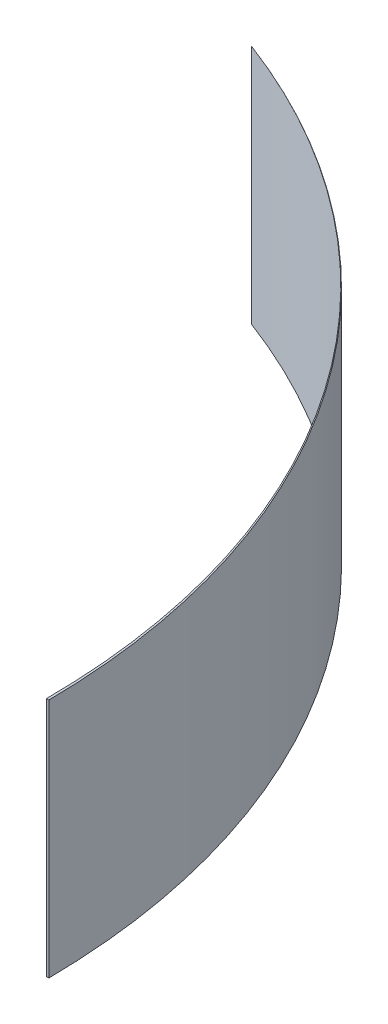
ISO-10303-21;
HEADER;
FILE_DESCRIPTION(('STEP AP214'),'2;1');
FILE_NAME('part.step','',(''),(''),'','','');
FILE_SCHEMA(('AUTOMOTIVE_DESIGN { 1 0 10303 214 1 1 1 1 }'));
ENDSEC;
DATA;
#1=APPLICATION_CONTEXT('core data for automotive mechanical design processes');
#2=APPLICATION_PROTOCOL_DEFINITION('international standard','automotive_design',2000,#1);
#3=PRODUCT_CONTEXT('',#1,'mechanical');
#4=PRODUCT('Part','Part','',(#3));
#5=PRODUCT_RELATED_PRODUCT_CATEGORY('part','',(#4));
#6=PRODUCT_DEFINITION_FORMATION('','',#4);
#7=PRODUCT_DEFINITION_CONTEXT('part definition',#1,'design');
#8=PRODUCT_DEFINITION('design','',#6,#7);
#9=PRODUCT_DEFINITION_SHAPE('','',#8);
#10=(LENGTH_UNIT() NAMED_UNIT(*) SI_UNIT(.MILLI.,.METRE.));
#11=(NAMED_UNIT(*) PLANE_ANGLE_UNIT() SI_UNIT($,.RADIAN.));
#12=(NAMED_UNIT(*) SI_UNIT($,.STERADIAN.) SOLID_ANGLE_UNIT());
#13=UNCERTAINTY_MEASURE_WITH_UNIT(LENGTH_MEASURE(1.E-05),#10,'distance_accuracy_value','');
#14=(GEOMETRIC_REPRESENTATION_CONTEXT(3) GLOBAL_UNCERTAINTY_ASSIGNED_CONTEXT((#13)) GLOBAL_UNIT_ASSIGNED_CONTEXT((#10,
#11,#12)) REPRESENTATION_CONTEXT('',''));
#15=CARTESIAN_POINT('',(0.,0.,0.));
#16=DIRECTION('',(0.,0.,1.));
#17=DIRECTION('',(1.,0.,0.));
#18=AXIS2_PLACEMENT_3D('',#15,#16,#17);
#19=CARTESIAN_POINT('',(-1190.95745518017,400.,8.9347516226103));
#20=DIRECTION('',(0.,-1.,0.));
#21=DIRECTION('',(0.,0.,-1.));
#22=AXIS2_PLACEMENT_3D('',#19,#20,#21);
#23=CYLINDRICAL_SURFACE('',#22,1194.99085748687);
#24=CARTESIAN_POINT('',(-1190.95745518017,0.,8.9347516226103));
#25=DIRECTION('',(0.,1.,0.));
#26=DIRECTION('',(0.,0.,1.));
#27=AXIS2_PLACEMENT_3D('',#24,#25,#26);
#28=CIRCLE('',#27,1194.99085748687);
#29=CARTESIAN_POINT('',(-768.618984425987,0.,-1108.93526121351));
#30=VERTEX_POINT('',#29);
#31=CARTESIAN_POINT('',(4.,0.,0.));
#32=VERTEX_POINT('',#31);
#33=EDGE_CURVE('E82',#30,#32,#28,.F.);
#34=ORIENTED_EDGE('',*,*,#33,.F.);
#35=DIRECTION('',(0.,-1.,0.));
#36=VECTOR('',#35,1.);
#37=CARTESIAN_POINT('',(-768.618984425987,400.,-1108.93526121351));
#38=LINE('',#37,#36);
#39=CARTESIAN_POINT('',(-768.618984425987,400.,-1108.93526121351));
#40=VERTEX_POINT('',#39);
#41=EDGE_CURVE('E11',#40,#30,#38,.T.);
#42=ORIENTED_EDGE('',*,*,#41,.F.);
#43=CARTESIAN_POINT('',(-1190.95745518017,400.,8.9347516226103));
#44=DIRECTION('',(0.,1.,0.));
#45=DIRECTION('',(0.,0.,1.));
#46=AXIS2_PLACEMENT_3D('',#43,#44,#45);
#47=CIRCLE('',#46,1194.99085748687);
#48=CARTESIAN_POINT('',(4.,400.,0.));
#49=VERTEX_POINT('',#48);
#50=EDGE_CURVE('E80',#40,#49,#47,.F.);
#51=ORIENTED_EDGE('',*,*,#50,.T.);
#52=DIRECTION('',(0.,-1.,0.));
#53=VECTOR('',#52,1.);
#54=CARTESIAN_POINT('',(4.,400.,0.));
#55=LINE('',#54,#53);
#56=EDGE_CURVE('E76',#49,#32,#55,.T.);
#57=ORIENTED_EDGE('',*,*,#56,.T.);
#58=EDGE_LOOP('',(#34,#42,#51,#57));
#59=FACE_BOUND('',#58,.T.);
#60=ADVANCED_FACE('F41',(#59),#23,.T.);
#61=CARTESIAN_POINT('',(-1189.99339949732,400.,3.96347736214275));
#62=DIRECTION('',(0.,-1.,0.));
#63=DIRECTION('',(0.,0.,-1.));
#64=AXIS2_PLACEMENT_3D('',#61,#62,#63);
#65=CYLINDRICAL_SURFACE('',#64,1190.);
#66=CARTESIAN_POINT('',(-1189.99339949732,0.,3.96347736214275));
#67=DIRECTION('',(0.,1.,0.));
#68=DIRECTION('',(0.,0.,1.));
#69=AXIS2_PLACEMENT_3D('',#66,#67,#68);
#70=CIRCLE('',#69,1190.);
#71=CARTESIAN_POINT('',(0.,0.,0.));
#72=VERTEX_POINT('',#71);
#73=EDGE_CURVE('E70',#30,#72,#70,.F.);
#74=ORIENTED_EDGE('',*,*,#73,.T.);
#75=DIRECTION('',(0.,-1.,0.));
#76=VECTOR('',#75,1.);
#77=CARTESIAN_POINT('',(0.,400.,0.));
#78=LINE('',#77,#76);
#79=CARTESIAN_POINT('',(0.,400.,0.));
#80=VERTEX_POINT('',#79);
#81=EDGE_CURVE('E50',#80,#72,#78,.T.);
#82=ORIENTED_EDGE('',*,*,#81,.F.);
#83=CARTESIAN_POINT('',(-1189.99339949732,400.,3.96347736214275));
#84=DIRECTION('',(0.,1.,0.));
#85=DIRECTION('',(0.,0.,1.));
#86=AXIS2_PLACEMENT_3D('',#83,#84,#85);
#87=CIRCLE('',#86,1190.);
#88=EDGE_CURVE('E83',#40,#80,#87,.F.);
#89=ORIENTED_EDGE('',*,*,#88,.F.);
#90=ORIENTED_EDGE('',*,*,#41,.T.);
#91=EDGE_LOOP('',(#74,#82,#89,#90));
#92=FACE_BOUND('',#91,.T.);
#93=ADVANCED_FACE('F84',(#92),#65,.F.);
#94=CARTESIAN_POINT('',(0.,400.,0.));
#95=DIRECTION('',(0.,0.,-1.));
#96=DIRECTION('',(-1.,0.,0.));
#97=AXIS2_PLACEMENT_3D('',#94,#95,#96);
#98=PLANE('',#97);
#99=DIRECTION('',(1.,0.,0.));
#100=VECTOR('',#99,1.);
#101=CARTESIAN_POINT('',(0.,0.,0.));
#102=LINE('',#101,#100);
#103=EDGE_CURVE('E89',#72,#32,#102,.T.);
#104=ORIENTED_EDGE('',*,*,#103,.T.);
#105=ORIENTED_EDGE('',*,*,#56,.F.);
#106=DIRECTION('',(1.,0.,0.));
#107=VECTOR('',#106,1.);
#108=CARTESIAN_POINT('',(0.,400.,0.));
#109=LINE('',#108,#107);
#110=EDGE_CURVE('E58',#80,#49,#109,.T.);
#111=ORIENTED_EDGE('',*,*,#110,.F.);
#112=ORIENTED_EDGE('',*,*,#81,.T.);
#113=EDGE_LOOP('',(#104,#105,#111,#112));
#114=FACE_BOUND('',#113,.T.);
#115=ADVANCED_FACE('F104',(#114),#98,.F.);
#116=CARTESIAN_POINT('',(0.,400.,0.));
#117=DIRECTION('',(0.,1.,0.));
#118=DIRECTION('',(0.,0.,1.));
#119=AXIS2_PLACEMENT_3D('',#116,#117,#118);
#120=PLANE('',#119);
#121=ORIENTED_EDGE('',*,*,#50,.F.);
#122=ORIENTED_EDGE('',*,*,#88,.T.);
#123=ORIENTED_EDGE('',*,*,#110,.T.);
#124=EDGE_LOOP('',(#121,#122,#123));
#125=FACE_BOUND('',#124,.T.);
#126=ADVANCED_FACE('F87',(#125),#120,.T.);
#127=CARTESIAN_POINT('',(0.,0.,0.));
#128=DIRECTION('',(0.,1.,0.));
#129=DIRECTION('',(0.,0.,1.));
#130=AXIS2_PLACEMENT_3D('',#127,#128,#129);
#131=PLANE('',#130);
#132=ORIENTED_EDGE('',*,*,#33,.T.);
#133=ORIENTED_EDGE('',*,*,#103,.F.);
#134=ORIENTED_EDGE('',*,*,#73,.F.);
#135=EDGE_LOOP('',(#132,#133,#134));
#136=FACE_BOUND('',#135,.T.);
#137=ADVANCED_FACE('F106',(#136),#131,.F.);
#138=CLOSED_SHELL('',(#60,#93,#115,#126,#137));
#139=MANIFOLD_SOLID_BREP('B2',#138);
#140=ADVANCED_BREP_SHAPE_REPRESENTATION('',(#18,#139),#14);
#141=SHAPE_DEFINITION_REPRESENTATION(#9,#140);
ENDSEC;
END-ISO-10303-21;
